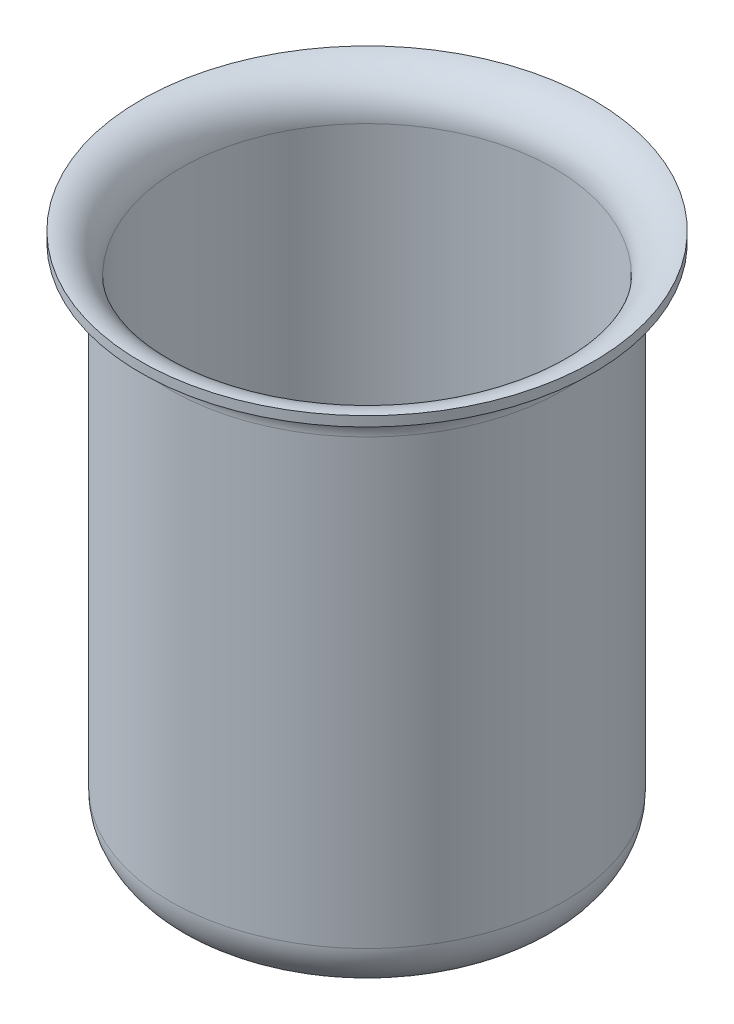
ISO-10303-21;
HEADER;
FILE_DESCRIPTION(('STEP AP214'),'2;1');
FILE_NAME('part.step','',(''),(''),'','','');
FILE_SCHEMA(('AUTOMOTIVE_DESIGN { 1 0 10303 214 1 1 1 1 }'));
ENDSEC;
DATA;
#1=APPLICATION_CONTEXT('core data for automotive mechanical design processes');
#2=APPLICATION_PROTOCOL_DEFINITION('international standard','automotive_design',2000,#1);
#3=PRODUCT_CONTEXT('',#1,'mechanical');
#4=PRODUCT('Part','Part','',(#3));
#5=PRODUCT_RELATED_PRODUCT_CATEGORY('part','',(#4));
#6=PRODUCT_DEFINITION_FORMATION('','',#4);
#7=PRODUCT_DEFINITION_CONTEXT('part definition',#1,'design');
#8=PRODUCT_DEFINITION('design','',#6,#7);
#9=PRODUCT_DEFINITION_SHAPE('','',#8);
#10=(LENGTH_UNIT() NAMED_UNIT(*) SI_UNIT(.MILLI.,.METRE.));
#11=(NAMED_UNIT(*) PLANE_ANGLE_UNIT() SI_UNIT($,.RADIAN.));
#12=(NAMED_UNIT(*) SI_UNIT($,.STERADIAN.) SOLID_ANGLE_UNIT());
#13=UNCERTAINTY_MEASURE_WITH_UNIT(LENGTH_MEASURE(1.E-05),#10,'distance_accuracy_value','');
#14=(GEOMETRIC_REPRESENTATION_CONTEXT(3) GLOBAL_UNCERTAINTY_ASSIGNED_CONTEXT((#13)) GLOBAL_UNIT_ASSIGNED_CONTEXT((#10,
#11,#12)) REPRESENTATION_CONTEXT('',''));
#15=CARTESIAN_POINT('',(0.,0.,0.));
#16=DIRECTION('',(0.,0.,1.));
#17=DIRECTION('',(1.,0.,0.));
#18=AXIS2_PLACEMENT_3D('',#15,#16,#17);
#19=CARTESIAN_POINT('',(0.,50.,0.));
#20=DIRECTION('',(0.,-1.,0.));
#21=DIRECTION('',(0.,0.,-1.));
#22=AXIS2_PLACEMENT_3D('',#19,#20,#21);
#23=TOROIDAL_SURFACE('',#22,23.,4.);
#24=CARTESIAN_POINT('',(0.,54.,0.));
#25=DIRECTION('',(0.,-1.,0.));
#26=DIRECTION('',(0.,0.,-1.));
#27=AXIS2_PLACEMENT_3D('',#24,#25,#26);
#28=CIRCLE('',#27,23.);
#29=CARTESIAN_POINT('',(0.,54.,-23.));
#30=VERTEX_POINT('',#29);
#31=EDGE_CURVE('E10',#30,#30,#28,.T.);
#32=ORIENTED_EDGE('',*,*,#31,.F.);
#33=EDGE_LOOP('',(#32));
#34=FACE_BOUND('',#33,.T.);
#35=CARTESIAN_POINT('',(0.,50.,0.));
#36=DIRECTION('',(0.,-1.,0.));
#37=DIRECTION('',(0.,0.,-1.));
#38=AXIS2_PLACEMENT_3D('',#35,#36,#37);
#39=CIRCLE('',#38,19.);
#40=CARTESIAN_POINT('',(0.,50.,-19.));
#41=VERTEX_POINT('',#40);
#42=EDGE_CURVE('E61',#41,#41,#39,.T.);
#43=ORIENTED_EDGE('',*,*,#42,.T.);
#44=EDGE_LOOP('',(#43));
#45=FACE_BOUND('',#44,.T.);
#46=ADVANCED_FACE('F33',(#34,#45),#23,.T.);
#47=CARTESIAN_POINT('',(0.,0.,0.));
#48=DIRECTION('',(0.,-1.,0.));
#49=DIRECTION('',(0.,0.,-1.));
#50=AXIS2_PLACEMENT_3D('',#47,#48,#49);
#51=CYLINDRICAL_SURFACE('',#50,23.);
#52=ORIENTED_EDGE('',*,*,#31,.T.);
#53=EDGE_LOOP('',(#52));
#54=FACE_BOUND('',#53,.T.);
#55=CARTESIAN_POINT('',(0.,53.,0.));
#56=DIRECTION('',(0.,-1.,0.));
#57=DIRECTION('',(0.,0.,-1.));
#58=AXIS2_PLACEMENT_3D('',#55,#56,#57);
#59=CIRCLE('',#58,23.);
#60=CARTESIAN_POINT('',(0.,53.,-23.));
#61=VERTEX_POINT('',#60);
#62=EDGE_CURVE('E39',#61,#61,#59,.T.);
#63=ORIENTED_EDGE('',*,*,#62,.F.);
#64=EDGE_LOOP('',(#63));
#65=FACE_BOUND('',#64,.T.);
#66=ADVANCED_FACE('F89',(#54,#65),#51,.T.);
#67=CARTESIAN_POINT('',(0.,50.,0.));
#68=DIRECTION('',(0.,-1.,0.));
#69=DIRECTION('',(0.,0.,-1.));
#70=AXIS2_PLACEMENT_3D('',#67,#68,#69);
#71=TOROIDAL_SURFACE('',#70,23.,3.);
#72=ORIENTED_EDGE('',*,*,#62,.T.);
#73=EDGE_LOOP('',(#72));
#74=FACE_BOUND('',#73,.T.);
#75=CARTESIAN_POINT('',(0.,50.,0.));
#76=DIRECTION('',(0.,-1.,0.));
#77=DIRECTION('',(0.,0.,-1.));
#78=AXIS2_PLACEMENT_3D('',#75,#76,#77);
#79=CIRCLE('',#78,20.);
#80=CARTESIAN_POINT('',(0.,50.,-20.));
#81=VERTEX_POINT('',#80);
#82=EDGE_CURVE('E43',#81,#81,#79,.T.);
#83=ORIENTED_EDGE('',*,*,#82,.F.);
#84=EDGE_LOOP('',(#83));
#85=FACE_BOUND('',#84,.T.);
#86=ADVANCED_FACE('F94',(#74,#85),#71,.F.);
#87=CARTESIAN_POINT('',(0.,0.,0.));
#88=DIRECTION('',(0.,-1.,0.));
#89=DIRECTION('',(0.,0.,-1.));
#90=AXIS2_PLACEMENT_3D('',#87,#88,#89);
#91=CYLINDRICAL_SURFACE('',#90,20.);
#92=ORIENTED_EDGE('',*,*,#82,.T.);
#93=EDGE_LOOP('',(#92));
#94=FACE_BOUND('',#93,.T.);
#95=CARTESIAN_POINT('',(0.,5.00000000000003,0.));
#96=DIRECTION('',(0.,-1.,0.));
#97=DIRECTION('',(0.,0.,-1.));
#98=AXIS2_PLACEMENT_3D('',#95,#96,#97);
#99=CIRCLE('',#98,20.);
#100=CARTESIAN_POINT('',(0.,5.00000000000003,-20.));
#101=VERTEX_POINT('',#100);
#102=EDGE_CURVE('E47',#101,#101,#99,.T.);
#103=ORIENTED_EDGE('',*,*,#102,.F.);
#104=EDGE_LOOP('',(#103));
#105=FACE_BOUND('',#104,.T.);
#106=ADVANCED_FACE('F98',(#94,#105),#91,.T.);
#107=CARTESIAN_POINT('',(0.,5.,0.));
#108=DIRECTION('',(0.,-1.,0.));
#109=DIRECTION('',(0.,0.,-1.));
#110=AXIS2_PLACEMENT_3D('',#107,#108,#109);
#111=TOROIDAL_SURFACE('',#110,15.,5.);
#112=ORIENTED_EDGE('',*,*,#102,.T.);
#113=EDGE_LOOP('',(#112));
#114=FACE_BOUND('',#113,.T.);
#115=CARTESIAN_POINT('',(0.,0.,0.));
#116=DIRECTION('',(0.,-1.,0.));
#117=DIRECTION('',(0.,0.,-1.));
#118=AXIS2_PLACEMENT_3D('',#115,#116,#117);
#119=CIRCLE('',#118,15.);
#120=CARTESIAN_POINT('',(0.,0.,-15.));
#121=VERTEX_POINT('',#120);
#122=EDGE_CURVE('E52',#121,#121,#119,.T.);
#123=ORIENTED_EDGE('',*,*,#122,.F.);
#124=EDGE_LOOP('',(#123));
#125=FACE_BOUND('',#124,.T.);
#126=ADVANCED_FACE('F85',(#114,#125),#111,.T.);
#127=CARTESIAN_POINT('',(0.,0.,0.));
#128=DIRECTION('',(0.,-1.,0.));
#129=DIRECTION('',(0.,0.,-1.));
#130=AXIS2_PLACEMENT_3D('',#127,#128,#129);
#131=PLANE('',#130);
#132=ORIENTED_EDGE('',*,*,#122,.T.);
#133=EDGE_LOOP('',(#132));
#134=FACE_BOUND('',#133,.T.);
#135=ADVANCED_FACE('F80',(#134),#131,.T.);
#136=CARTESIAN_POINT('',(0.,0.999999999999999,0.));
#137=DIRECTION('',(0.,-1.,0.));
#138=DIRECTION('',(0.,0.,-1.));
#139=AXIS2_PLACEMENT_3D('',#136,#137,#138);
#140=PLANE('',#139);
#141=CARTESIAN_POINT('',(0.,0.999999999999998,0.));
#142=DIRECTION('',(0.,-1.,0.));
#143=DIRECTION('',(0.,0.,-1.));
#144=AXIS2_PLACEMENT_3D('',#141,#142,#143);
#145=CIRCLE('',#144,15.);
#146=CARTESIAN_POINT('',(0.,0.999999999999998,-15.));
#147=VERTEX_POINT('',#146);
#148=EDGE_CURVE('E55',#147,#147,#145,.T.);
#149=ORIENTED_EDGE('',*,*,#148,.F.);
#150=EDGE_LOOP('',(#149));
#151=FACE_BOUND('',#150,.T.);
#152=ADVANCED_FACE('F75',(#151),#140,.F.);
#153=CARTESIAN_POINT('',(0.,5.,0.));
#154=DIRECTION('',(0.,-1.,0.));
#155=DIRECTION('',(0.,0.,-1.));
#156=AXIS2_PLACEMENT_3D('',#153,#154,#155);
#157=TOROIDAL_SURFACE('',#156,15.,4.);
#158=CARTESIAN_POINT('',(0.,5.00000000000003,0.));
#159=DIRECTION('',(0.,-1.,0.));
#160=DIRECTION('',(0.,0.,-1.));
#161=AXIS2_PLACEMENT_3D('',#158,#159,#160);
#162=CIRCLE('',#161,19.);
#163=CARTESIAN_POINT('',(0.,5.00000000000003,-19.));
#164=VERTEX_POINT('',#163);
#165=EDGE_CURVE('E58',#164,#164,#162,.T.);
#166=ORIENTED_EDGE('',*,*,#165,.F.);
#167=EDGE_LOOP('',(#166));
#168=FACE_BOUND('',#167,.T.);
#169=ORIENTED_EDGE('',*,*,#148,.T.);
#170=EDGE_LOOP('',(#169));
#171=FACE_BOUND('',#170,.T.);
#172=ADVANCED_FACE('F69',(#168,#171),#157,.F.);
#173=CARTESIAN_POINT('',(0.,0.,0.));
#174=DIRECTION('',(0.,-1.,0.));
#175=DIRECTION('',(0.,0.,-1.));
#176=AXIS2_PLACEMENT_3D('',#173,#174,#175);
#177=CYLINDRICAL_SURFACE('',#176,19.);
#178=ORIENTED_EDGE('',*,*,#42,.F.);
#179=EDGE_LOOP('',(#178));
#180=FACE_BOUND('',#179,.T.);
#181=ORIENTED_EDGE('',*,*,#165,.T.);
#182=EDGE_LOOP('',(#181));
#183=FACE_BOUND('',#182,.T.);
#184=ADVANCED_FACE('F66',(#180,#183),#177,.F.);
#185=CLOSED_SHELL('',(#46,#66,#86,#106,#126,#135,#152,#172,#184));
#186=MANIFOLD_SOLID_BREP('B2',#185);
#187=ADVANCED_BREP_SHAPE_REPRESENTATION('',(#18,#186),#14);
#188=SHAPE_DEFINITION_REPRESENTATION(#9,#187);
ENDSEC;
END-ISO-10303-21;
